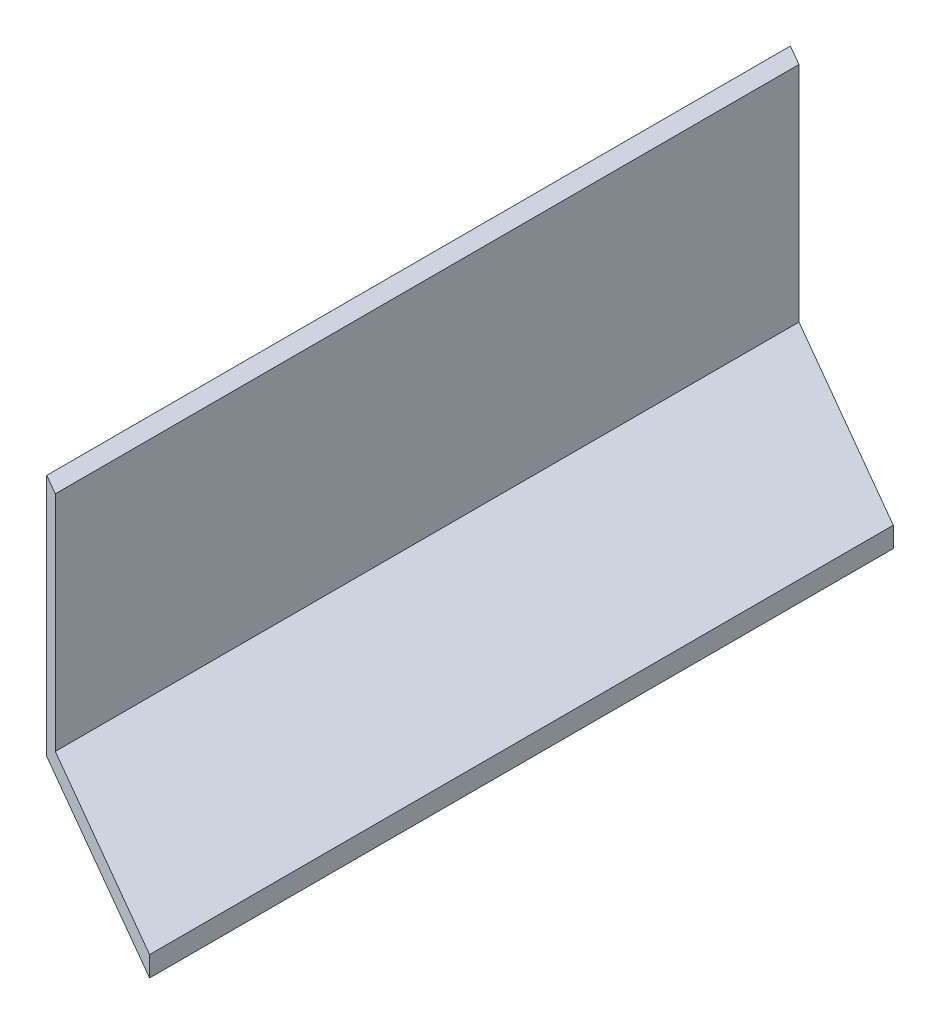
ISO-10303-21;
HEADER;
FILE_DESCRIPTION(('STEP AP214'),'2;1');
FILE_NAME('part.step','',(''),(''),'','','');
FILE_SCHEMA(('AUTOMOTIVE_DESIGN { 1 0 10303 214 1 1 1 1 }'));
ENDSEC;
DATA;
#1=APPLICATION_CONTEXT('core data for automotive mechanical design processes');
#2=APPLICATION_PROTOCOL_DEFINITION('international standard','automotive_design',2000,#1);
#3=PRODUCT_CONTEXT('',#1,'mechanical');
#4=PRODUCT('Part','Part','',(#3));
#5=PRODUCT_RELATED_PRODUCT_CATEGORY('part','',(#4));
#6=PRODUCT_DEFINITION_FORMATION('','',#4);
#7=PRODUCT_DEFINITION_CONTEXT('part definition',#1,'design');
#8=PRODUCT_DEFINITION('design','',#6,#7);
#9=PRODUCT_DEFINITION_SHAPE('','',#8);
#10=(LENGTH_UNIT() NAMED_UNIT(*) SI_UNIT(.MILLI.,.METRE.));
#11=(NAMED_UNIT(*) PLANE_ANGLE_UNIT() SI_UNIT($,.RADIAN.));
#12=(NAMED_UNIT(*) SI_UNIT($,.STERADIAN.) SOLID_ANGLE_UNIT());
#13=UNCERTAINTY_MEASURE_WITH_UNIT(LENGTH_MEASURE(1.E-05),#10,'distance_accuracy_value','');
#14=(GEOMETRIC_REPRESENTATION_CONTEXT(3) GLOBAL_UNCERTAINTY_ASSIGNED_CONTEXT((#13)) GLOBAL_UNIT_ASSIGNED_CONTEXT((#10,
#11,#12)) REPRESENTATION_CONTEXT('',''));
#15=CARTESIAN_POINT('',(0.,0.,0.));
#16=DIRECTION('',(0.,0.,1.));
#17=DIRECTION('',(1.,0.,0.));
#18=AXIS2_PLACEMENT_3D('',#15,#16,#17);
#19=CARTESIAN_POINT('',(0.,0.,138.43));
#20=DIRECTION('',(1.,0.,0.));
#21=DIRECTION('',(0.,0.,-1.));
#22=AXIS2_PLACEMENT_3D('',#19,#20,#21);
#23=PLANE('',#22);
#24=DIRECTION('',(0.,0.,-1.));
#25=VECTOR('',#24,1.);
#26=CARTESIAN_POINT('',(0.,0.,138.43));
#27=LINE('',#26,#25);
#28=CARTESIAN_POINT('',(0.,0.,116.432954743875));
#29=VERTEX_POINT('',#28);
#30=CARTESIAN_POINT('',(0.,0.,0.));
#31=VERTEX_POINT('',#30);
#32=EDGE_CURVE('E108',#29,#31,#27,.T.);
#33=ORIENTED_EDGE('',*,*,#32,.F.);
#34=DIRECTION('',(0.,-1.,0.));
#35=VECTOR('',#34,1.);
#36=CARTESIAN_POINT('',(0.,38.1,116.432954743875));
#37=LINE('',#36,#35);
#38=CARTESIAN_POINT('',(0.,38.1,116.432954743875));
#39=VERTEX_POINT('',#38);
#40=EDGE_CURVE('E104',#39,#29,#37,.T.);
#41=ORIENTED_EDGE('',*,*,#40,.F.);
#42=DIRECTION('',(0.,0.,-1.));
#43=VECTOR('',#42,1.);
#44=CARTESIAN_POINT('',(0.,38.1,138.43));
#45=LINE('',#44,#43);
#46=CARTESIAN_POINT('',(0.,38.1,0.));
#47=VERTEX_POINT('',#46);
#48=EDGE_CURVE('E98',#39,#47,#45,.T.);
#49=ORIENTED_EDGE('',*,*,#48,.T.);
#50=DIRECTION('',(0.,-1.,0.));
#51=VECTOR('',#50,1.);
#52=CARTESIAN_POINT('',(0.,0.,0.));
#53=LINE('',#52,#51);
#54=EDGE_CURVE('E82',#47,#31,#53,.T.);
#55=ORIENTED_EDGE('',*,*,#54,.T.);
#56=EDGE_LOOP('',(#33,#41,#49,#55));
#57=FACE_BOUND('',#56,.T.);
#58=ADVANCED_FACE('F33',(#57),#23,.F.);
#59=CARTESIAN_POINT('',(0.,0.,138.43));
#60=DIRECTION('',(0.,1.,0.));
#61=DIRECTION('',(0.,0.,1.));
#62=AXIS2_PLACEMENT_3D('',#59,#60,#61);
#63=PLANE('',#62);
#64=ORIENTED_EDGE('',*,*,#32,.T.);
#65=DIRECTION('',(-0.866025403784441,0.,-0.499999999999995));
#66=VECTOR('',#65,1.);
#67=CARTESIAN_POINT('',(38.1,0.,21.9970452561244));
#68=LINE('',#67,#66);
#69=CARTESIAN_POINT('',(38.1,0.,21.9970452561244));
#70=VERTEX_POINT('',#69);
#71=EDGE_CURVE('E85',#70,#31,#68,.T.);
#72=ORIENTED_EDGE('',*,*,#71,.F.);
#73=DIRECTION('',(0.,0.,-1.));
#74=VECTOR('',#73,1.);
#75=CARTESIAN_POINT('',(38.1,0.,138.43));
#76=LINE('',#75,#74);
#77=CARTESIAN_POINT('',(38.1,0.,138.43));
#78=VERTEX_POINT('',#77);
#79=EDGE_CURVE('E105',#78,#70,#76,.T.);
#80=ORIENTED_EDGE('',*,*,#79,.F.);
#81=DIRECTION('',(0.866025403784436,0.,0.500000000000004));
#82=VECTOR('',#81,1.);
#83=CARTESIAN_POINT('',(38.1,0.,138.43));
#84=LINE('',#83,#82);
#85=EDGE_CURVE('E131',#29,#78,#84,.T.);
#86=ORIENTED_EDGE('',*,*,#85,.F.);
#87=EDGE_LOOP('',(#64,#72,#80,#86));
#88=FACE_BOUND('',#87,.T.);
#89=ADVANCED_FACE('F139',(#88),#63,.F.);
#90=CARTESIAN_POINT('',(38.1,0.,138.43));
#91=DIRECTION('',(-1.,0.,0.));
#92=DIRECTION('',(0.,0.,1.));
#93=AXIS2_PLACEMENT_3D('',#90,#91,#92);
#94=PLANE('',#93);
#95=ORIENTED_EDGE('',*,*,#79,.T.);
#96=DIRECTION('',(0.,-1.,0.));
#97=VECTOR('',#96,1.);
#98=CARTESIAN_POINT('',(38.1,38.1,21.9970452561244));
#99=LINE('',#98,#97);
#100=CARTESIAN_POINT('',(38.1,3.17500000000001,21.9970452561244));
#101=VERTEX_POINT('',#100);
#102=EDGE_CURVE('E101',#101,#70,#99,.T.);
#103=ORIENTED_EDGE('',*,*,#102,.F.);
#104=DIRECTION('',(0.,0.,1.));
#105=VECTOR('',#104,1.);
#106=CARTESIAN_POINT('',(38.1,3.175,0.));
#107=LINE('',#106,#105);
#108=CARTESIAN_POINT('',(38.1,3.17500000000001,138.43));
#109=VERTEX_POINT('',#108);
#110=EDGE_CURVE('E91',#101,#109,#107,.T.);
#111=ORIENTED_EDGE('',*,*,#110,.T.);
#112=DIRECTION('',(0.,1.,0.));
#113=VECTOR('',#112,1.);
#114=CARTESIAN_POINT('',(38.1,0.,138.43));
#115=LINE('',#114,#113);
#116=EDGE_CURVE('E90',#78,#109,#115,.T.);
#117=ORIENTED_EDGE('',*,*,#116,.F.);
#118=EDGE_LOOP('',(#95,#103,#111,#117));
#119=FACE_BOUND('',#118,.T.);
#120=ADVANCED_FACE('F142',(#119),#94,.F.);
#121=CARTESIAN_POINT('',(0.,38.1,138.43));
#122=DIRECTION('',(0.,-1.,0.));
#123=DIRECTION('',(0.,0.,-1.));
#124=AXIS2_PLACEMENT_3D('',#121,#122,#123);
#125=PLANE('',#124);
#126=DIRECTION('',(0.,0.,1.));
#127=VECTOR('',#126,1.);
#128=CARTESIAN_POINT('',(3.175,38.1,0.));
#129=LINE('',#128,#127);
#130=CARTESIAN_POINT('',(3.175,38.1,1.83308710467703));
#131=VERTEX_POINT('',#130);
#132=CARTESIAN_POINT('',(3.175,38.1,118.266041848552));
#133=VERTEX_POINT('',#132);
#134=EDGE_CURVE('E100',#131,#133,#129,.T.);
#135=ORIENTED_EDGE('',*,*,#134,.F.);
#136=DIRECTION('',(-0.866025403784441,0.,-0.499999999999995));
#137=VECTOR('',#136,1.);
#138=CARTESIAN_POINT('',(38.1,38.1,21.9970452561244));
#139=LINE('',#138,#137);
#140=EDGE_CURVE('E47',#131,#47,#139,.T.);
#141=ORIENTED_EDGE('',*,*,#140,.T.);
#142=ORIENTED_EDGE('',*,*,#48,.F.);
#143=DIRECTION('',(0.866025403784436,0.,0.500000000000004));
#144=VECTOR('',#143,1.);
#145=CARTESIAN_POINT('',(38.1,38.1,138.43));
#146=LINE('',#145,#144);
#147=EDGE_CURVE('E130',#39,#133,#146,.T.);
#148=ORIENTED_EDGE('',*,*,#147,.T.);
#149=EDGE_LOOP('',(#135,#141,#142,#148));
#150=FACE_BOUND('',#149,.T.);
#151=ADVANCED_FACE('F96',(#150),#125,.F.);
#152=CARTESIAN_POINT('',(38.1,3.175,0.));
#153=DIRECTION('',(0.,-1.,0.));
#154=DIRECTION('',(1.,0.,0.));
#155=AXIS2_PLACEMENT_3D('',#152,#153,#154);
#156=PLANE('',#155);
#157=ORIENTED_EDGE('',*,*,#110,.F.);
#158=DIRECTION('',(-0.866025403784442,0.,-0.499999999999995));
#159=VECTOR('',#158,1.);
#160=CARTESIAN_POINT('',(28.5750000000002,3.175,16.4977839420934));
#161=LINE('',#160,#159);
#162=CARTESIAN_POINT('',(3.175,3.175,1.83308710467703));
#163=VERTEX_POINT('',#162);
#164=EDGE_CURVE('E122',#101,#163,#161,.T.);
#165=ORIENTED_EDGE('',*,*,#164,.T.);
#166=DIRECTION('',(0.,0.,1.));
#167=VECTOR('',#166,1.);
#168=CARTESIAN_POINT('',(3.175,3.17499999999999,0.));
#169=LINE('',#168,#167);
#170=CARTESIAN_POINT('',(3.175,3.17499999999999,118.266041848552));
#171=VERTEX_POINT('',#170);
#172=EDGE_CURVE('E116',#163,#171,#169,.T.);
#173=ORIENTED_EDGE('',*,*,#172,.T.);
#174=DIRECTION('',(0.866025403784436,0.,0.500000000000005));
#175=VECTOR('',#174,1.);
#176=CARTESIAN_POINT('',(-21.8419483229403,3.17499999999999,103.822499999999));
#177=LINE('',#176,#175);
#178=EDGE_CURVE('E54',#171,#109,#177,.T.);
#179=ORIENTED_EDGE('',*,*,#178,.T.);
#180=EDGE_LOOP('',(#157,#165,#173,#179));
#181=FACE_BOUND('',#180,.T.);
#182=ADVANCED_FACE('F120',(#181),#156,.F.);
#183=CARTESIAN_POINT('',(3.175,38.1,0.));
#184=DIRECTION('',(-1.,0.,0.));
#185=DIRECTION('',(0.,-1.,0.));
#186=AXIS2_PLACEMENT_3D('',#183,#184,#185);
#187=PLANE('',#186);
#188=ORIENTED_EDGE('',*,*,#172,.F.);
#189=DIRECTION('',(0.,1.,0.));
#190=VECTOR('',#189,1.);
#191=CARTESIAN_POINT('',(3.175,38.1,1.83308710467703));
#192=LINE('',#191,#190);
#193=EDGE_CURVE('E11',#163,#131,#192,.T.);
#194=ORIENTED_EDGE('',*,*,#193,.T.);
#195=ORIENTED_EDGE('',*,*,#134,.T.);
#196=DIRECTION('',(0.,-1.,0.));
#197=VECTOR('',#196,1.);
#198=CARTESIAN_POINT('',(3.175,38.1,118.266041848552));
#199=LINE('',#198,#197);
#200=EDGE_CURVE('E40',#133,#171,#199,.T.);
#201=ORIENTED_EDGE('',*,*,#200,.T.);
#202=EDGE_LOOP('',(#188,#194,#195,#201));
#203=FACE_BOUND('',#202,.T.);
#204=ADVANCED_FACE('F115',(#203),#187,.F.);
#205=CARTESIAN_POINT('',(38.1,38.1,138.43));
#206=DIRECTION('',(0.500000000000004,0.,-0.866025403784436));
#207=DIRECTION('',(-0.866025403784436,0.,-0.500000000000005));
#208=AXIS2_PLACEMENT_3D('',#205,#206,#207);
#209=PLANE('',#208);
#210=ORIENTED_EDGE('',*,*,#200,.F.);
#211=ORIENTED_EDGE('',*,*,#147,.F.);
#212=ORIENTED_EDGE('',*,*,#40,.T.);
#213=ORIENTED_EDGE('',*,*,#85,.T.);
#214=ORIENTED_EDGE('',*,*,#116,.T.);
#215=ORIENTED_EDGE('',*,*,#178,.F.);
#216=EDGE_LOOP('',(#210,#211,#212,#213,#214,#215));
#217=FACE_BOUND('',#216,.T.);
#218=ADVANCED_FACE('F143',(#217),#209,.F.);
#219=CARTESIAN_POINT('',(38.1,38.1,21.9970452561244));
#220=DIRECTION('',(-0.499999999999995,0.,0.866025403784442));
#221=DIRECTION('',(0.866025403784442,0.,0.499999999999995));
#222=AXIS2_PLACEMENT_3D('',#219,#220,#221);
#223=PLANE('',#222);
#224=ORIENTED_EDGE('',*,*,#102,.T.);
#225=ORIENTED_EDGE('',*,*,#71,.T.);
#226=ORIENTED_EDGE('',*,*,#54,.F.);
#227=ORIENTED_EDGE('',*,*,#140,.F.);
#228=ORIENTED_EDGE('',*,*,#193,.F.);
#229=ORIENTED_EDGE('',*,*,#164,.F.);
#230=EDGE_LOOP('',(#224,#225,#226,#227,#228,#229));
#231=FACE_BOUND('',#230,.T.);
#232=ADVANCED_FACE('F83',(#231),#223,.F.);
#233=CLOSED_SHELL('',(#58,#89,#120,#151,#182,#204,#218,#232));
#234=MANIFOLD_SOLID_BREP('B2',#233);
#235=ADVANCED_BREP_SHAPE_REPRESENTATION('',(#18,#234),#14);
#236=SHAPE_DEFINITION_REPRESENTATION(#9,#235);
ENDSEC;
END-ISO-10303-21;
